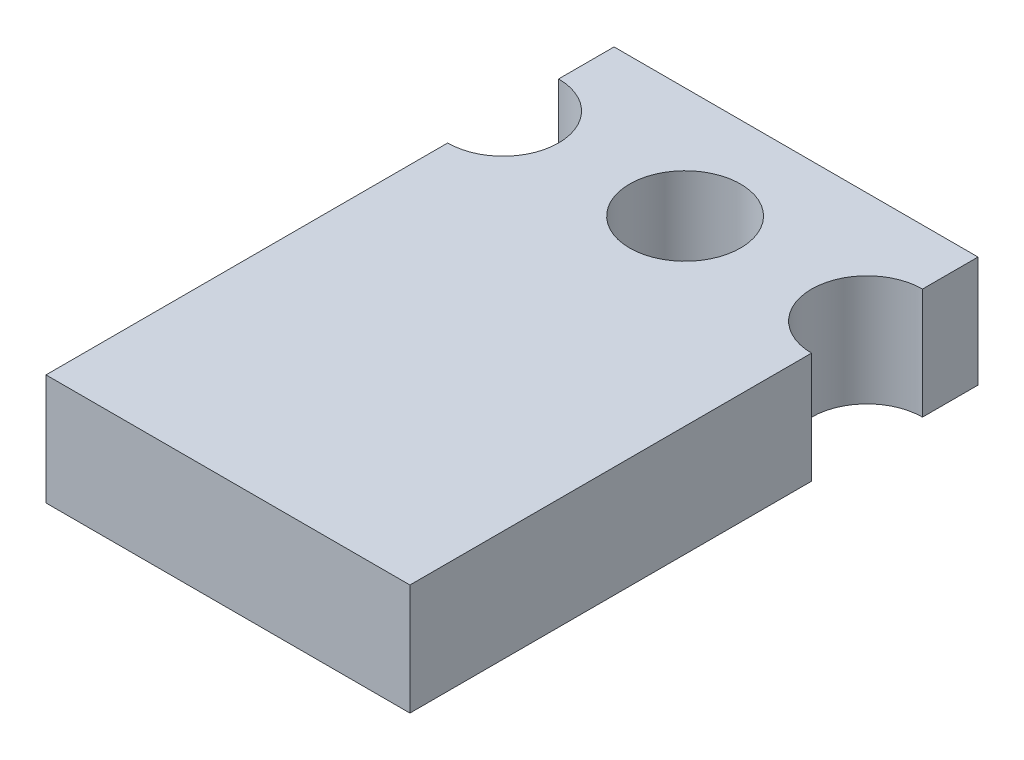
ISO-10303-21;
HEADER;
FILE_DESCRIPTION(('STEP AP214'),'2;1');
FILE_NAME('part.step','',(''),(''),'','','');
FILE_SCHEMA(('AUTOMOTIVE_DESIGN { 1 0 10303 214 1 1 1 1 }'));
ENDSEC;
DATA;
#1=APPLICATION_CONTEXT('core data for automotive mechanical design processes');
#2=APPLICATION_PROTOCOL_DEFINITION('international standard','automotive_design',2000,#1);
#3=PRODUCT_CONTEXT('',#1,'mechanical');
#4=PRODUCT('Part','Part','',(#3));
#5=PRODUCT_RELATED_PRODUCT_CATEGORY('part','',(#4));
#6=PRODUCT_DEFINITION_FORMATION('','',#4);
#7=PRODUCT_DEFINITION_CONTEXT('part definition',#1,'design');
#8=PRODUCT_DEFINITION('design','',#6,#7);
#9=PRODUCT_DEFINITION_SHAPE('','',#8);
#10=(LENGTH_UNIT() NAMED_UNIT(*) SI_UNIT(.MILLI.,.METRE.));
#11=(NAMED_UNIT(*) PLANE_ANGLE_UNIT() SI_UNIT($,.RADIAN.));
#12=(NAMED_UNIT(*) SI_UNIT($,.STERADIAN.) SOLID_ANGLE_UNIT());
#13=UNCERTAINTY_MEASURE_WITH_UNIT(LENGTH_MEASURE(1.E-05),#10,'distance_accuracy_value','');
#14=(GEOMETRIC_REPRESENTATION_CONTEXT(3) GLOBAL_UNCERTAINTY_ASSIGNED_CONTEXT((#13)) GLOBAL_UNIT_ASSIGNED_CONTEXT((#10,
#11,#12)) REPRESENTATION_CONTEXT('',''));
#15=CARTESIAN_POINT('',(0.,0.,0.));
#16=DIRECTION('',(0.,0.,1.));
#17=DIRECTION('',(1.,0.,0.));
#18=AXIS2_PLACEMENT_3D('',#15,#16,#17);
#19=CARTESIAN_POINT('',(10.414,3.175,0.));
#20=DIRECTION('',(-1.,0.,0.));
#21=DIRECTION('',(0.,0.,1.));
#22=AXIS2_PLACEMENT_3D('',#19,#20,#21);
#23=PLANE('',#22);
#24=DIRECTION('',(0.,0.,-1.));
#25=VECTOR('',#24,1.);
#26=CARTESIAN_POINT('',(10.414,0.,0.));
#27=LINE('',#26,#25);
#28=CARTESIAN_POINT('',(10.414,0.,0.));
#29=VERTEX_POINT('',#28);
#30=CARTESIAN_POINT('',(10.414,0.,-11.4935));
#31=VERTEX_POINT('',#30);
#32=EDGE_CURVE('E124',#29,#31,#27,.T.);
#33=ORIENTED_EDGE('',*,*,#32,.T.);
#34=DIRECTION('',(0.,1.,0.));
#35=VECTOR('',#34,1.);
#36=CARTESIAN_POINT('',(10.414,0.,-11.4935));
#37=LINE('',#36,#35);
#38=CARTESIAN_POINT('',(10.414,3.175,-11.4935));
#39=VERTEX_POINT('',#38);
#40=EDGE_CURVE('E55',#31,#39,#37,.T.);
#41=ORIENTED_EDGE('',*,*,#40,.T.);
#42=DIRECTION('',(0.,0.,-1.));
#43=VECTOR('',#42,1.);
#44=CARTESIAN_POINT('',(10.414,3.175,0.));
#45=LINE('',#44,#43);
#46=CARTESIAN_POINT('',(10.414,3.175,0.));
#47=VERTEX_POINT('',#46);
#48=EDGE_CURVE('E156',#47,#39,#45,.T.);
#49=ORIENTED_EDGE('',*,*,#48,.F.);
#50=DIRECTION('',(0.,-1.,0.));
#51=VECTOR('',#50,1.);
#52=CARTESIAN_POINT('',(10.414,3.175,0.));
#53=LINE('',#52,#51);
#54=EDGE_CURVE('E48',#47,#29,#53,.T.);
#55=ORIENTED_EDGE('',*,*,#54,.T.);
#56=EDGE_LOOP('',(#33,#41,#49,#55));
#57=FACE_BOUND('',#56,.T.);
#58=ADVANCED_FACE('F39',(#57),#23,.F.);
#59=CARTESIAN_POINT('',(0.,3.175,0.));
#60=DIRECTION('',(-1.,0.,0.));
#61=DIRECTION('',(0.,0.,1.));
#62=AXIS2_PLACEMENT_3D('',#59,#60,#61);
#63=PLANE('',#62);
#64=DIRECTION('',(0.,1.,0.));
#65=VECTOR('',#64,1.);
#66=CARTESIAN_POINT('',(0.,0.,-11.4935));
#67=LINE('',#66,#65);
#68=CARTESIAN_POINT('',(0.,0.,-11.4935));
#69=VERTEX_POINT('',#68);
#70=CARTESIAN_POINT('',(0.,3.175,-11.4935));
#71=VERTEX_POINT('',#70);
#72=EDGE_CURVE('E130',#69,#71,#67,.T.);
#73=ORIENTED_EDGE('',*,*,#72,.F.);
#74=DIRECTION('',(0.,0.,-1.));
#75=VECTOR('',#74,1.);
#76=CARTESIAN_POINT('',(0.,0.,0.));
#77=LINE('',#76,#75);
#78=CARTESIAN_POINT('',(0.,0.,0.));
#79=VERTEX_POINT('',#78);
#80=EDGE_CURVE('E137',#79,#69,#77,.T.);
#81=ORIENTED_EDGE('',*,*,#80,.F.);
#82=DIRECTION('',(0.,-1.,0.));
#83=VECTOR('',#82,1.);
#84=CARTESIAN_POINT('',(0.,3.175,0.));
#85=LINE('',#84,#83);
#86=CARTESIAN_POINT('',(0.,3.175,0.));
#87=VERTEX_POINT('',#86);
#88=EDGE_CURVE('E141',#87,#79,#85,.T.);
#89=ORIENTED_EDGE('',*,*,#88,.F.);
#90=DIRECTION('',(0.,0.,-1.));
#91=VECTOR('',#90,1.);
#92=CARTESIAN_POINT('',(0.,3.175,0.));
#93=LINE('',#92,#91);
#94=EDGE_CURVE('E145',#87,#71,#93,.T.);
#95=ORIENTED_EDGE('',*,*,#94,.T.);
#96=EDGE_LOOP('',(#73,#81,#89,#95));
#97=FACE_BOUND('',#96,.T.);
#98=ADVANCED_FACE('F164',(#97),#63,.T.);
#99=CARTESIAN_POINT('',(0.,3.175,0.));
#100=DIRECTION('',(0.,0.,-1.));
#101=DIRECTION('',(-1.,0.,0.));
#102=AXIS2_PLACEMENT_3D('',#99,#100,#101);
#103=PLANE('',#102);
#104=DIRECTION('',(1.,0.,0.));
#105=VECTOR('',#104,1.);
#106=CARTESIAN_POINT('',(0.,0.,0.));
#107=LINE('',#106,#105);
#108=EDGE_CURVE('E125',#79,#29,#107,.T.);
#109=ORIENTED_EDGE('',*,*,#108,.T.);
#110=ORIENTED_EDGE('',*,*,#54,.F.);
#111=DIRECTION('',(1.,0.,0.));
#112=VECTOR('',#111,1.);
#113=CARTESIAN_POINT('',(0.,3.175,0.));
#114=LINE('',#113,#112);
#115=EDGE_CURVE('E140',#87,#47,#114,.T.);
#116=ORIENTED_EDGE('',*,*,#115,.F.);
#117=ORIENTED_EDGE('',*,*,#88,.T.);
#118=EDGE_LOOP('',(#109,#110,#116,#117));
#119=FACE_BOUND('',#118,.T.);
#120=ADVANCED_FACE('F41',(#119),#103,.F.);
#121=CARTESIAN_POINT('',(10.414,3.175,-14.6685));
#122=VERTEX_POINT('',#121);
#123=CARTESIAN_POINT('',(10.414,3.175,-16.256));
#124=VERTEX_POINT('',#123);
#125=EDGE_CURVE('E114',#122,#124,#45,.T.);
#126=ORIENTED_EDGE('',*,*,#125,.F.);
#127=DIRECTION('',(0.,1.,0.));
#128=VECTOR('',#127,1.);
#129=CARTESIAN_POINT('',(10.414,0.,-14.6685));
#130=LINE('',#129,#128);
#131=CARTESIAN_POINT('',(10.414,0.,-14.6685));
#132=VERTEX_POINT('',#131);
#133=EDGE_CURVE('E103',#122,#132,#130,.F.);
#134=ORIENTED_EDGE('',*,*,#133,.T.);
#135=CARTESIAN_POINT('',(10.414,0.,-16.256));
#136=VERTEX_POINT('',#135);
#137=EDGE_CURVE('E112',#132,#136,#27,.T.);
#138=ORIENTED_EDGE('',*,*,#137,.T.);
#139=DIRECTION('',(0.,-1.,0.));
#140=VECTOR('',#139,1.);
#141=CARTESIAN_POINT('',(10.414,3.175,-16.256));
#142=LINE('',#141,#140);
#143=EDGE_CURVE('E149',#124,#136,#142,.T.);
#144=ORIENTED_EDGE('',*,*,#143,.F.);
#145=EDGE_LOOP('',(#126,#134,#138,#144));
#146=FACE_BOUND('',#145,.T.);
#147=ADVANCED_FACE('F110',(#146),#23,.F.);
#148=CARTESIAN_POINT('',(0.,3.175,-16.256));
#149=DIRECTION('',(0.,0.,-1.));
#150=DIRECTION('',(-1.,0.,0.));
#151=AXIS2_PLACEMENT_3D('',#148,#149,#150);
#152=PLANE('',#151);
#153=DIRECTION('',(1.,0.,0.));
#154=VECTOR('',#153,1.);
#155=CARTESIAN_POINT('',(0.,0.,-16.256));
#156=LINE('',#155,#154);
#157=CARTESIAN_POINT('',(0.,0.,-16.256));
#158=VERTEX_POINT('',#157);
#159=EDGE_CURVE('E122',#158,#136,#156,.T.);
#160=ORIENTED_EDGE('',*,*,#159,.F.);
#161=DIRECTION('',(0.,-1.,0.));
#162=VECTOR('',#161,1.);
#163=CARTESIAN_POINT('',(0.,3.175,-16.256));
#164=LINE('',#163,#162);
#165=CARTESIAN_POINT('',(0.,3.175,-16.256));
#166=VERTEX_POINT('',#165);
#167=EDGE_CURVE('E144',#166,#158,#164,.T.);
#168=ORIENTED_EDGE('',*,*,#167,.F.);
#169=DIRECTION('',(1.,0.,0.));
#170=VECTOR('',#169,1.);
#171=CARTESIAN_POINT('',(0.,3.175,-16.256));
#172=LINE('',#171,#170);
#173=EDGE_CURVE('E178',#166,#124,#172,.T.);
#174=ORIENTED_EDGE('',*,*,#173,.T.);
#175=ORIENTED_EDGE('',*,*,#143,.T.);
#176=EDGE_LOOP('',(#160,#168,#174,#175));
#177=FACE_BOUND('',#176,.T.);
#178=ADVANCED_FACE('F192',(#177),#152,.T.);
#179=DIRECTION('',(0.,1.,0.));
#180=VECTOR('',#179,1.);
#181=CARTESIAN_POINT('',(0.,0.,-14.6685));
#182=LINE('',#181,#180);
#183=CARTESIAN_POINT('',(0.,3.175,-14.6685));
#184=VERTEX_POINT('',#183);
#185=CARTESIAN_POINT('',(0.,0.,-14.6685));
#186=VERTEX_POINT('',#185);
#187=EDGE_CURVE('E62',#184,#186,#182,.F.);
#188=ORIENTED_EDGE('',*,*,#187,.F.);
#189=EDGE_CURVE('E181',#184,#166,#93,.T.);
#190=ORIENTED_EDGE('',*,*,#189,.T.);
#191=ORIENTED_EDGE('',*,*,#167,.T.);
#192=EDGE_CURVE('E136',#186,#158,#77,.T.);
#193=ORIENTED_EDGE('',*,*,#192,.F.);
#194=EDGE_LOOP('',(#188,#190,#191,#193));
#195=FACE_BOUND('',#194,.T.);
#196=ADVANCED_FACE('F187',(#195),#63,.T.);
#197=CARTESIAN_POINT('',(0.,3.175,0.));
#198=DIRECTION('',(0.,1.,0.));
#199=DIRECTION('',(0.,0.,1.));
#200=AXIS2_PLACEMENT_3D('',#197,#198,#199);
#201=PLANE('',#200);
#202=CARTESIAN_POINT('',(0.,3.175,-13.081));
#203=DIRECTION('',(0.,1.,0.));
#204=DIRECTION('',(0.,0.,1.));
#205=AXIS2_PLACEMENT_3D('',#202,#203,#204);
#206=CIRCLE('',#205,1.5875);
#207=EDGE_CURVE('E200',#71,#184,#206,.T.);
#208=ORIENTED_EDGE('',*,*,#207,.F.);
#209=ORIENTED_EDGE('',*,*,#94,.F.);
#210=ORIENTED_EDGE('',*,*,#115,.T.);
#211=ORIENTED_EDGE('',*,*,#48,.T.);
#212=CARTESIAN_POINT('',(10.414,3.175,-13.081));
#213=DIRECTION('',(0.,1.,0.));
#214=DIRECTION('',(0.,0.,1.));
#215=AXIS2_PLACEMENT_3D('',#212,#213,#214);
#216=CIRCLE('',#215,1.5875);
#217=EDGE_CURVE('E195',#122,#39,#216,.T.);
#218=ORIENTED_EDGE('',*,*,#217,.F.);
#219=ORIENTED_EDGE('',*,*,#125,.T.);
#220=ORIENTED_EDGE('',*,*,#173,.F.);
#221=ORIENTED_EDGE('',*,*,#189,.F.);
#222=EDGE_LOOP('',(#208,#209,#210,#211,#218,#219,#220,#221));
#223=FACE_BOUND('',#222,.T.);
#224=CARTESIAN_POINT('',(5.207,3.175,-13.081));
#225=DIRECTION('',(0.,1.,0.));
#226=DIRECTION('',(0.,0.,1.));
#227=AXIS2_PLACEMENT_3D('',#224,#225,#226);
#228=CIRCLE('',#227,1.5875);
#229=CARTESIAN_POINT('',(5.207,3.175,-11.4935));
#230=VERTEX_POINT('',#229);
#231=EDGE_CURVE('E204',#230,#230,#228,.T.);
#232=ORIENTED_EDGE('',*,*,#231,.F.);
#233=EDGE_LOOP('',(#232));
#234=FACE_BOUND('',#233,.T.);
#235=ADVANCED_FACE('F193',(#223,#234),#201,.T.);
#236=CARTESIAN_POINT('',(0.,0.,0.));
#237=DIRECTION('',(0.,1.,0.));
#238=DIRECTION('',(0.,0.,1.));
#239=AXIS2_PLACEMENT_3D('',#236,#237,#238);
#240=PLANE('',#239);
#241=CARTESIAN_POINT('',(5.207,0.,-13.081));
#242=DIRECTION('',(0.,1.,0.));
#243=DIRECTION('',(0.,0.,1.));
#244=AXIS2_PLACEMENT_3D('',#241,#242,#243);
#245=CIRCLE('',#244,1.5875);
#246=CARTESIAN_POINT('',(5.207,0.,-11.4935));
#247=VERTEX_POINT('',#246);
#248=EDGE_CURVE('E116',#247,#247,#245,.T.);
#249=ORIENTED_EDGE('',*,*,#248,.T.);
#250=EDGE_LOOP('',(#249));
#251=FACE_BOUND('',#250,.T.);
#252=ORIENTED_EDGE('',*,*,#80,.T.);
#253=CARTESIAN_POINT('',(0.,0.,-13.081));
#254=DIRECTION('',(0.,1.,0.));
#255=DIRECTION('',(0.,0.,1.));
#256=AXIS2_PLACEMENT_3D('',#253,#254,#255);
#257=CIRCLE('',#256,1.5875);
#258=EDGE_CURVE('E198',#69,#186,#257,.T.);
#259=ORIENTED_EDGE('',*,*,#258,.T.);
#260=ORIENTED_EDGE('',*,*,#192,.T.);
#261=ORIENTED_EDGE('',*,*,#159,.T.);
#262=ORIENTED_EDGE('',*,*,#137,.F.);
#263=CARTESIAN_POINT('',(10.414,0.,-13.081));
#264=DIRECTION('',(0.,1.,0.));
#265=DIRECTION('',(0.,0.,1.));
#266=AXIS2_PLACEMENT_3D('',#263,#264,#265);
#267=CIRCLE('',#266,1.5875);
#268=EDGE_CURVE('E11',#132,#31,#267,.T.);
#269=ORIENTED_EDGE('',*,*,#268,.T.);
#270=ORIENTED_EDGE('',*,*,#32,.F.);
#271=ORIENTED_EDGE('',*,*,#108,.F.);
#272=EDGE_LOOP('',(#252,#259,#260,#261,#262,#269,#270,#271));
#273=FACE_BOUND('',#272,.T.);
#274=ADVANCED_FACE('F120',(#251,#273),#240,.F.);
#275=CARTESIAN_POINT('',(5.207,0.,-13.081));
#276=DIRECTION('',(0.,1.,0.));
#277=DIRECTION('',(0.,0.,1.));
#278=AXIS2_PLACEMENT_3D('',#275,#276,#277);
#279=CYLINDRICAL_SURFACE('',#278,1.5875);
#280=ORIENTED_EDGE('',*,*,#248,.F.);
#281=EDGE_LOOP('',(#280));
#282=FACE_BOUND('',#281,.T.);
#283=ORIENTED_EDGE('',*,*,#231,.T.);
#284=EDGE_LOOP('',(#283));
#285=FACE_BOUND('',#284,.T.);
#286=ADVANCED_FACE('F220',(#282,#285),#279,.F.);
#287=CARTESIAN_POINT('',(10.414,0.,-13.081));
#288=DIRECTION('',(0.,1.,0.));
#289=DIRECTION('',(0.,0.,1.));
#290=AXIS2_PLACEMENT_3D('',#287,#288,#289);
#291=CYLINDRICAL_SURFACE('',#290,1.5875);
#292=ORIENTED_EDGE('',*,*,#268,.F.);
#293=ORIENTED_EDGE('',*,*,#133,.F.);
#294=ORIENTED_EDGE('',*,*,#217,.T.);
#295=ORIENTED_EDGE('',*,*,#40,.F.);
#296=EDGE_LOOP('',(#292,#293,#294,#295));
#297=FACE_BOUND('',#296,.T.);
#298=ADVANCED_FACE('F102',(#297),#291,.F.);
#299=CARTESIAN_POINT('',(0.,0.,-13.081));
#300=DIRECTION('',(0.,1.,0.));
#301=DIRECTION('',(0.,0.,1.));
#302=AXIS2_PLACEMENT_3D('',#299,#300,#301);
#303=CYLINDRICAL_SURFACE('',#302,1.5875);
#304=ORIENTED_EDGE('',*,*,#72,.T.);
#305=ORIENTED_EDGE('',*,*,#207,.T.);
#306=ORIENTED_EDGE('',*,*,#187,.T.);
#307=ORIENTED_EDGE('',*,*,#258,.F.);
#308=EDGE_LOOP('',(#304,#305,#306,#307));
#309=FACE_BOUND('',#308,.T.);
#310=ADVANCED_FACE('F214',(#309),#303,.F.);
#311=CLOSED_SHELL('',(#58,#98,#120,#147,#178,#196,#235,#274,#286,#298,#310));
#312=MANIFOLD_SOLID_BREP('B2',#311);
#313=ADVANCED_BREP_SHAPE_REPRESENTATION('',(#18,#312),#14);
#314=SHAPE_DEFINITION_REPRESENTATION(#9,#313);
ENDSEC;
END-ISO-10303-21;
